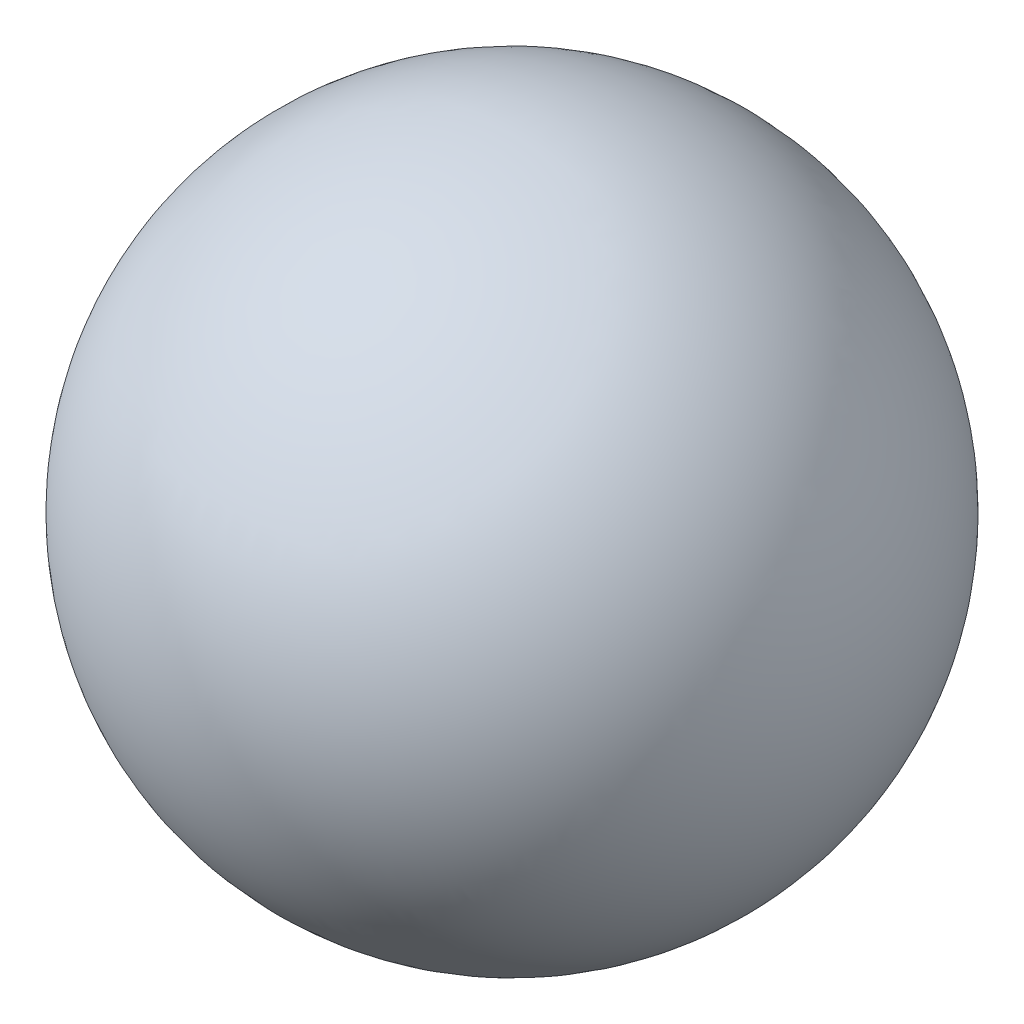
ISO-10303-21;
HEADER;
FILE_DESCRIPTION(('STEP AP214'),'2;1');
FILE_NAME('part.step','',(''),(''),'','','');
FILE_SCHEMA(('AUTOMOTIVE_DESIGN { 1 0 10303 214 1 1 1 1 }'));
ENDSEC;
DATA;
#1=APPLICATION_CONTEXT('core data for automotive mechanical design processes');
#2=APPLICATION_PROTOCOL_DEFINITION('international standard','automotive_design',2000,#1);
#3=PRODUCT_CONTEXT('',#1,'mechanical');
#4=PRODUCT('Part','Part','',(#3));
#5=PRODUCT_RELATED_PRODUCT_CATEGORY('part','',(#4));
#6=PRODUCT_DEFINITION_FORMATION('','',#4);
#7=PRODUCT_DEFINITION_CONTEXT('part definition',#1,'design');
#8=PRODUCT_DEFINITION('design','',#6,#7);
#9=PRODUCT_DEFINITION_SHAPE('','',#8);
#10=(LENGTH_UNIT() NAMED_UNIT(*) SI_UNIT(.MILLI.,.METRE.));
#11=(NAMED_UNIT(*) PLANE_ANGLE_UNIT() SI_UNIT($,.RADIAN.));
#12=(NAMED_UNIT(*) SI_UNIT($,.STERADIAN.) SOLID_ANGLE_UNIT());
#13=UNCERTAINTY_MEASURE_WITH_UNIT(LENGTH_MEASURE(1.E-05),#10,'distance_accuracy_value','');
#14=(GEOMETRIC_REPRESENTATION_CONTEXT(3) GLOBAL_UNCERTAINTY_ASSIGNED_CONTEXT((#13)) GLOBAL_UNIT_ASSIGNED_CONTEXT((#10,
#11,#12)) REPRESENTATION_CONTEXT('',''));
#15=CARTESIAN_POINT('',(0.,0.,0.));
#16=DIRECTION('',(0.,0.,1.));
#17=DIRECTION('',(1.,0.,0.));
#18=AXIS2_PLACEMENT_3D('',#15,#16,#17);
#19=CARTESIAN_POINT('',(0.,0.,0.));
#20=DIRECTION('',(0.,0.,1.));
#21=DIRECTION('',(-1.,0.,0.));
#22=AXIS2_PLACEMENT_3D('',#19,#20,#21);
#23=ELLIPSE('',#22,250.,250.);
#24=TRIMMED_CURVE('',#23,(PARAMETER_VALUE(3.14159265358979)),
(PARAMETER_VALUE(6.28318530717959)),.T.,.PARAMETER.);
#25=CARTESIAN_POINT('',(-2000.,0.,0.));
#26=DIRECTION('',(-1.,0.,0.));
#27=AXIS1_PLACEMENT('',#25,#26);
#28=SURFACE_OF_REVOLUTION('',#24,#27);
#29=CARTESIAN_POINT('',(-250.,0.,0.));
#30=VERTEX_POINT('',#29);
#31=VERTEX_LOOP('',#30);
#32=FACE_BOUND('',#31,.T.);
#33=CARTESIAN_POINT('',(250.,0.,0.));
#34=VERTEX_POINT('',#33);
#35=VERTEX_LOOP('',#34);
#36=FACE_BOUND('',#35,.T.);
#37=ADVANCED_FACE('F25',(#32,#36),#28,.T.);
#38=CLOSED_SHELL('',(#37));
#39=MANIFOLD_SOLID_BREP('B2',#38);
#40=ADVANCED_BREP_SHAPE_REPRESENTATION('',(#18,#39),#14);
#41=SHAPE_DEFINITION_REPRESENTATION(#9,#40);
ENDSEC;
END-ISO-10303-21;
